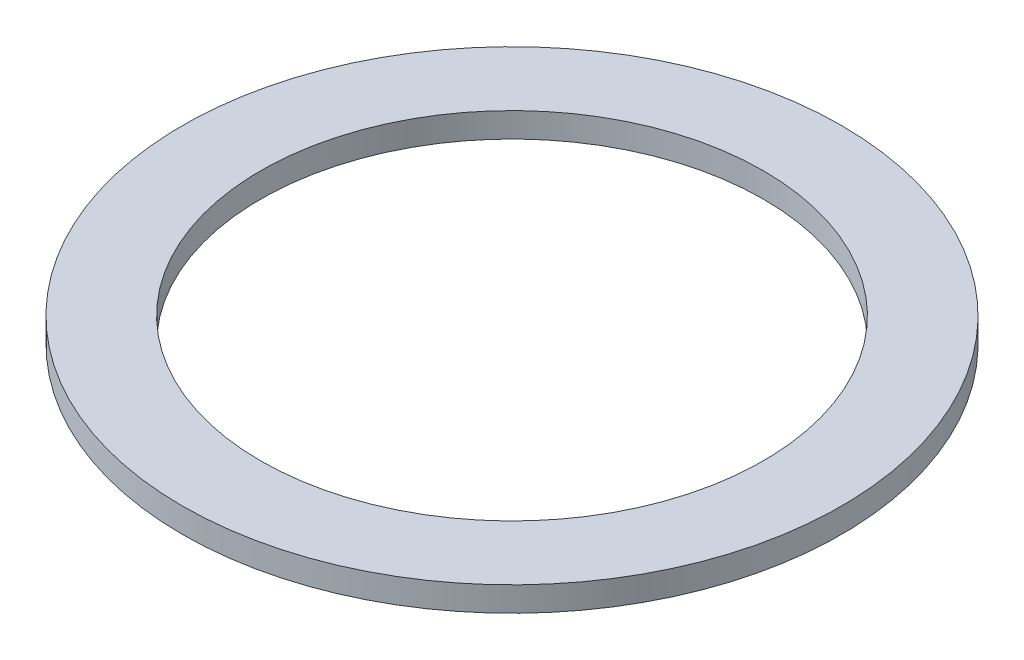
ISO-10303-21;
HEADER;
FILE_DESCRIPTION(('STEP AP214'),'2;1');
FILE_NAME('part.step','',(''),(''),'','','');
FILE_SCHEMA(('AUTOMOTIVE_DESIGN { 1 0 10303 214 1 1 1 1 }'));
ENDSEC;
DATA;
#1=APPLICATION_CONTEXT('core data for automotive mechanical design processes');
#2=APPLICATION_PROTOCOL_DEFINITION('international standard','automotive_design',2000,#1);
#3=PRODUCT_CONTEXT('',#1,'mechanical');
#4=PRODUCT('Part','Part','',(#3));
#5=PRODUCT_RELATED_PRODUCT_CATEGORY('part','',(#4));
#6=PRODUCT_DEFINITION_FORMATION('','',#4);
#7=PRODUCT_DEFINITION_CONTEXT('part definition',#1,'design');
#8=PRODUCT_DEFINITION('design','',#6,#7);
#9=PRODUCT_DEFINITION_SHAPE('','',#8);
#10=(LENGTH_UNIT() NAMED_UNIT(*) SI_UNIT(.MILLI.,.METRE.));
#11=(NAMED_UNIT(*) PLANE_ANGLE_UNIT() SI_UNIT($,.RADIAN.));
#12=(NAMED_UNIT(*) SI_UNIT($,.STERADIAN.) SOLID_ANGLE_UNIT());
#13=UNCERTAINTY_MEASURE_WITH_UNIT(LENGTH_MEASURE(1.E-05),#10,'distance_accuracy_value','');
#14=(GEOMETRIC_REPRESENTATION_CONTEXT(3) GLOBAL_UNCERTAINTY_ASSIGNED_CONTEXT((#13)) GLOBAL_UNIT_ASSIGNED_CONTEXT((#10,
#11,#12)) REPRESENTATION_CONTEXT('',''));
#15=CARTESIAN_POINT('',(0.,0.,0.));
#16=DIRECTION('',(0.,0.,1.));
#17=DIRECTION('',(1.,0.,0.));
#18=AXIS2_PLACEMENT_3D('',#15,#16,#17);
#19=CARTESIAN_POINT('',(0.,0.508,0.));
#20=DIRECTION('',(0.,1.,0.));
#21=DIRECTION('',(0.,0.,1.));
#22=AXIS2_PLACEMENT_3D('',#19,#20,#21);
#23=PLANE('',#22);
#24=CARTESIAN_POINT('',(0.,0.508,0.));
#25=DIRECTION('',(0.,1.,0.));
#26=DIRECTION('',(0.,0.,1.));
#27=AXIS2_PLACEMENT_3D('',#24,#25,#26);
#28=CIRCLE('',#27,6.7945);
#29=CARTESIAN_POINT('',(0.,0.508,6.7945));
#30=VERTEX_POINT('',#29);
#31=EDGE_CURVE('E10',#30,#30,#28,.T.);
#32=ORIENTED_EDGE('',*,*,#31,.T.);
#33=EDGE_LOOP('',(#32));
#34=FACE_BOUND('',#33,.T.);
#35=CARTESIAN_POINT('',(0.,0.508,0.));
#36=DIRECTION('',(0.,1.,0.));
#37=DIRECTION('',(0.,0.,1.));
#38=AXIS2_PLACEMENT_3D('',#35,#36,#37);
#39=CIRCLE('',#38,5.1816);
#40=CARTESIAN_POINT('',(0.,0.508,5.1816));
#41=VERTEX_POINT('',#40);
#42=EDGE_CURVE('E41',#41,#41,#39,.T.);
#43=ORIENTED_EDGE('',*,*,#42,.F.);
#44=EDGE_LOOP('',(#43));
#45=FACE_BOUND('',#44,.T.);
#46=ADVANCED_FACE('F30',(#34,#45),#23,.T.);
#47=CARTESIAN_POINT('',(0.,0.,0.));
#48=DIRECTION('',(0.,1.,0.));
#49=DIRECTION('',(0.,0.,1.));
#50=AXIS2_PLACEMENT_3D('',#47,#48,#49);
#51=PLANE('',#50);
#52=CARTESIAN_POINT('',(0.,0.,0.));
#53=DIRECTION('',(0.,1.,0.));
#54=DIRECTION('',(0.,0.,1.));
#55=AXIS2_PLACEMENT_3D('',#52,#53,#54);
#56=CIRCLE('',#55,6.7945);
#57=CARTESIAN_POINT('',(0.,0.,6.7945));
#58=VERTEX_POINT('',#57);
#59=EDGE_CURVE('E34',#58,#58,#56,.T.);
#60=ORIENTED_EDGE('',*,*,#59,.F.);
#61=EDGE_LOOP('',(#60));
#62=FACE_BOUND('',#61,.T.);
#63=CARTESIAN_POINT('',(0.,0.,0.));
#64=DIRECTION('',(0.,1.,0.));
#65=DIRECTION('',(0.,0.,1.));
#66=AXIS2_PLACEMENT_3D('',#63,#64,#65);
#67=CIRCLE('',#66,5.1816);
#68=CARTESIAN_POINT('',(0.,0.,5.1816));
#69=VERTEX_POINT('',#68);
#70=EDGE_CURVE('E43',#69,#69,#67,.T.);
#71=ORIENTED_EDGE('',*,*,#70,.T.);
#72=EDGE_LOOP('',(#71));
#73=FACE_BOUND('',#72,.T.);
#74=ADVANCED_FACE('F53',(#62,#73),#51,.F.);
#75=CARTESIAN_POINT('',(0.,0.508,0.));
#76=DIRECTION('',(0.,-1.,0.));
#77=DIRECTION('',(0.,0.,-1.));
#78=AXIS2_PLACEMENT_3D('',#75,#76,#77);
#79=CYLINDRICAL_SURFACE('',#78,6.7945);
#80=ORIENTED_EDGE('',*,*,#31,.F.);
#81=EDGE_LOOP('',(#80));
#82=FACE_BOUND('',#81,.T.);
#83=ORIENTED_EDGE('',*,*,#59,.T.);
#84=EDGE_LOOP('',(#83));
#85=FACE_BOUND('',#84,.T.);
#86=ADVANCED_FACE('F32',(#82,#85),#79,.T.);
#87=CARTESIAN_POINT('',(0.,0.508,0.));
#88=DIRECTION('',(0.,-1.,0.));
#89=DIRECTION('',(0.,0.,-1.));
#90=AXIS2_PLACEMENT_3D('',#87,#88,#89);
#91=CYLINDRICAL_SURFACE('',#90,5.1816);
#92=ORIENTED_EDGE('',*,*,#42,.T.);
#93=EDGE_LOOP('',(#92));
#94=FACE_BOUND('',#93,.T.);
#95=ORIENTED_EDGE('',*,*,#70,.F.);
#96=EDGE_LOOP('',(#95));
#97=FACE_BOUND('',#96,.T.);
#98=ADVANCED_FACE('F49',(#94,#97),#91,.F.);
#99=CLOSED_SHELL('',(#46,#74,#86,#98));
#100=MANIFOLD_SOLID_BREP('B2',#99);
#101=ADVANCED_BREP_SHAPE_REPRESENTATION('',(#18,#100),#14);
#102=SHAPE_DEFINITION_REPRESENTATION(#9,#101);
ENDSEC;
END-ISO-10303-21;
